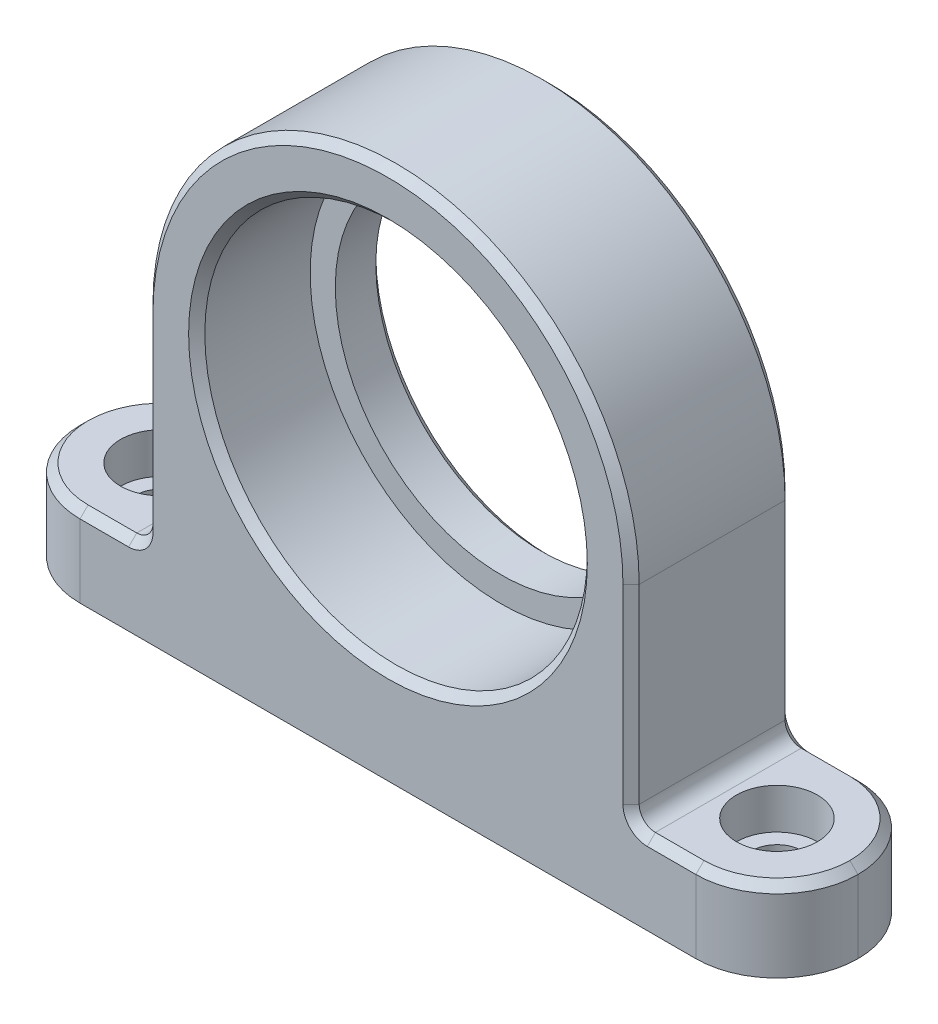
ISO-10303-21;
HEADER;
FILE_DESCRIPTION(('STEP AP214'),'2;1');
FILE_NAME('part.step','',(''),(''),'','','');
FILE_SCHEMA(('AUTOMOTIVE_DESIGN { 1 0 10303 214 1 1 1 1 }'));
ENDSEC;
DATA;
#1=APPLICATION_CONTEXT('core data for automotive mechanical design processes');
#2=APPLICATION_PROTOCOL_DEFINITION('international standard','automotive_design',2000,#1);
#3=PRODUCT_CONTEXT('',#1,'mechanical');
#4=PRODUCT('Part','Part','',(#3));
#5=PRODUCT_RELATED_PRODUCT_CATEGORY('part','',(#4));
#6=PRODUCT_DEFINITION_FORMATION('','',#4);
#7=PRODUCT_DEFINITION_CONTEXT('part definition',#1,'design');
#8=PRODUCT_DEFINITION('design','',#6,#7);
#9=PRODUCT_DEFINITION_SHAPE('','',#8);
#10=(LENGTH_UNIT() NAMED_UNIT(*) SI_UNIT(.MILLI.,.METRE.));
#11=(NAMED_UNIT(*) PLANE_ANGLE_UNIT() SI_UNIT($,.RADIAN.));
#12=(NAMED_UNIT(*) SI_UNIT($,.STERADIAN.) SOLID_ANGLE_UNIT());
#13=UNCERTAINTY_MEASURE_WITH_UNIT(LENGTH_MEASURE(1.E-05),#10,'distance_accuracy_value','');
#14=(GEOMETRIC_REPRESENTATION_CONTEXT(3) GLOBAL_UNCERTAINTY_ASSIGNED_CONTEXT((#13)) GLOBAL_UNIT_ASSIGNED_CONTEXT((#10,
#11,#12)) REPRESENTATION_CONTEXT('',''));
#15=CARTESIAN_POINT('',(0.,0.,0.));
#16=DIRECTION('',(0.,0.,1.));
#17=DIRECTION('',(1.,0.,0.));
#18=AXIS2_PLACEMENT_3D('',#15,#16,#17);
#19=CARTESIAN_POINT('',(-48.,10.,-10.));
#20=DIRECTION('',(0.,0.,-1.));
#21=DIRECTION('',(-1.,0.,0.));
#22=AXIS2_PLACEMENT_3D('',#19,#20,#21);
#23=PLANE('',#22);
#24=CARTESIAN_POINT('',(0.,35.5,-10.));
#25=DIRECTION('',(0.,0.,-1.));
#26=DIRECTION('',(-1.,0.,0.));
#27=AXIS2_PLACEMENT_3D('',#24,#25,#26);
#28=CIRCLE('',#27,21.5);
#29=CARTESIAN_POINT('',(-21.5,35.5,-10.));
#30=VERTEX_POINT('',#29);
#31=EDGE_CURVE('E385',#30,#30,#28,.F.);
#32=ORIENTED_EDGE('',*,*,#31,.T.);
#33=EDGE_LOOP('',(#32));
#34=FACE_BOUND('',#33,.T.);
#35=CARTESIAN_POINT('',(32.,12.,-10.));
#36=DIRECTION('',(0.,0.,-1.));
#37=DIRECTION('',(-1.,0.,0.));
#38=AXIS2_PLACEMENT_3D('',#35,#36,#37);
#39=CIRCLE('',#38,3.00000000000003);
#40=CARTESIAN_POINT('',(29.,12.,-10.));
#41=VERTEX_POINT('',#40);
#42=CARTESIAN_POINT('',(32.,8.99999999999997,-10.));
#43=VERTEX_POINT('',#42);
#44=EDGE_CURVE('E274',#41,#43,#39,.F.);
#45=ORIENTED_EDGE('',*,*,#44,.T.);
#46=DIRECTION('',(1.,0.,0.));
#47=VECTOR('',#46,1.);
#48=CARTESIAN_POINT('',(38.,8.99999999999997,-10.));
#49=LINE('',#48,#47);
#50=CARTESIAN_POINT('',(38.,8.99999999999997,-10.));
#51=VERTEX_POINT('',#50);
#52=EDGE_CURVE('E276',#43,#51,#49,.T.);
#53=ORIENTED_EDGE('',*,*,#52,.T.);
#54=DIRECTION('',(0.,-1.,0.));
#55=VECTOR('',#54,1.);
#56=CARTESIAN_POINT('',(38.,10.,-10.));
#57=LINE('',#56,#55);
#58=CARTESIAN_POINT('',(38.,0.,-10.));
#59=VERTEX_POINT('',#58);
#60=EDGE_CURVE('E200',#51,#59,#57,.T.);
#61=ORIENTED_EDGE('',*,*,#60,.T.);
#62=DIRECTION('',(1.,0.,0.));
#63=VECTOR('',#62,1.);
#64=CARTESIAN_POINT('',(-48.,0.,-10.));
#65=LINE('',#64,#63);
#66=CARTESIAN_POINT('',(-38.,0.,-10.));
#67=VERTEX_POINT('',#66);
#68=EDGE_CURVE('E193',#67,#59,#65,.T.);
#69=ORIENTED_EDGE('',*,*,#68,.F.);
#70=DIRECTION('',(0.,-1.,0.));
#71=VECTOR('',#70,1.);
#72=CARTESIAN_POINT('',(-38.,10.,-10.));
#73=LINE('',#72,#71);
#74=CARTESIAN_POINT('',(-38.,8.99999999999997,-10.));
#75=VERTEX_POINT('',#74);
#76=EDGE_CURVE('E204',#67,#75,#73,.F.);
#77=ORIENTED_EDGE('',*,*,#76,.T.);
#78=DIRECTION('',(1.,0.,0.));
#79=VECTOR('',#78,1.);
#80=CARTESIAN_POINT('',(-32.,8.99999999999997,-10.));
#81=LINE('',#80,#79);
#82=CARTESIAN_POINT('',(-32.,8.99999999999997,-10.));
#83=VERTEX_POINT('',#82);
#84=EDGE_CURVE('E263',#75,#83,#81,.T.);
#85=ORIENTED_EDGE('',*,*,#84,.T.);
#86=CARTESIAN_POINT('',(-32.,12.,-10.));
#87=DIRECTION('',(0.,0.,-1.));
#88=DIRECTION('',(-1.,0.,0.));
#89=AXIS2_PLACEMENT_3D('',#86,#87,#88);
#90=CIRCLE('',#89,3.00000000000003);
#91=CARTESIAN_POINT('',(-29.,12.,-10.));
#92=VERTEX_POINT('',#91);
#93=EDGE_CURVE('E265',#83,#92,#90,.F.);
#94=ORIENTED_EDGE('',*,*,#93,.T.);
#95=DIRECTION('',(0.,1.,0.));
#96=VECTOR('',#95,1.);
#97=CARTESIAN_POINT('',(-29.,35.5,-10.));
#98=LINE('',#97,#96);
#99=CARTESIAN_POINT('',(-29.,35.5,-10.));
#100=VERTEX_POINT('',#99);
#101=EDGE_CURVE('E267',#92,#100,#98,.T.);
#102=ORIENTED_EDGE('',*,*,#101,.T.);
#103=CARTESIAN_POINT('',(0.,35.5,-10.));
#104=DIRECTION('',(0.,0.,-1.));
#105=DIRECTION('',(-1.,0.,0.));
#106=AXIS2_PLACEMENT_3D('',#103,#104,#105);
#107=CIRCLE('',#106,29.);
#108=CARTESIAN_POINT('',(29.,35.5,-10.));
#109=VERTEX_POINT('',#108);
#110=EDGE_CURVE('E269',#100,#109,#107,.T.);
#111=ORIENTED_EDGE('',*,*,#110,.T.);
#112=DIRECTION('',(0.,-1.,0.));
#113=VECTOR('',#112,1.);
#114=CARTESIAN_POINT('',(29.,12.,-10.));
#115=LINE('',#114,#113);
#116=EDGE_CURVE('E272',#109,#41,#115,.T.);
#117=ORIENTED_EDGE('',*,*,#116,.T.);
#118=EDGE_LOOP('',(#45,#53,#61,#69,#77,#85,#94,#102,#111,#117));
#119=FACE_BOUND('',#118,.T.);
#120=ADVANCED_FACE('F44',(#34,#119),#23,.T.);
#121=CARTESIAN_POINT('',(-48.,10.,10.));
#122=DIRECTION('',(0.,0.,-1.));
#123=DIRECTION('',(-1.,0.,0.));
#124=AXIS2_PLACEMENT_3D('',#121,#122,#123);
#125=PLANE('',#124);
#126=CARTESIAN_POINT('',(0.,35.5,10.));
#127=DIRECTION('',(0.,0.,-1.));
#128=DIRECTION('',(-1.,0.,0.));
#129=AXIS2_PLACEMENT_3D('',#126,#127,#128);
#130=CIRCLE('',#129,24.6);
#131=CARTESIAN_POINT('',(-24.6,35.5,10.));
#132=VERTEX_POINT('',#131);
#133=EDGE_CURVE('E11',#132,#132,#130,.T.);
#134=ORIENTED_EDGE('',*,*,#133,.T.);
#135=EDGE_LOOP('',(#134));
#136=FACE_BOUND('',#135,.T.);
#137=DIRECTION('',(0.,-1.,0.));
#138=VECTOR('',#137,1.);
#139=CARTESIAN_POINT('',(38.,10.,10.));
#140=LINE('',#139,#138);
#141=CARTESIAN_POINT('',(38.,0.,10.));
#142=VERTEX_POINT('',#141);
#143=CARTESIAN_POINT('',(38.,8.99999999999997,10.));
#144=VERTEX_POINT('',#143);
#145=EDGE_CURVE('E226',#142,#144,#140,.F.);
#146=ORIENTED_EDGE('',*,*,#145,.T.);
#147=DIRECTION('',(-1.,0.,0.));
#148=VECTOR('',#147,1.);
#149=CARTESIAN_POINT('',(-48.,8.99999999999997,10.));
#150=LINE('',#149,#148);
#151=CARTESIAN_POINT('',(32.,8.99999999999997,10.));
#152=VERTEX_POINT('',#151);
#153=EDGE_CURVE('E60',#144,#152,#150,.T.);
#154=ORIENTED_EDGE('',*,*,#153,.T.);
#155=CARTESIAN_POINT('',(32.,12.,10.));
#156=DIRECTION('',(0.,0.,-1.));
#157=DIRECTION('',(-1.,0.,0.));
#158=AXIS2_PLACEMENT_3D('',#155,#156,#157);
#159=CIRCLE('',#158,3.00000000000003);
#160=CARTESIAN_POINT('',(29.,12.,10.));
#161=VERTEX_POINT('',#160);
#162=EDGE_CURVE('E324',#152,#161,#159,.T.);
#163=ORIENTED_EDGE('',*,*,#162,.T.);
#164=DIRECTION('',(0.,1.,0.));
#165=VECTOR('',#164,1.);
#166=CARTESIAN_POINT('',(29.,10.,10.));
#167=LINE('',#166,#165);
#168=CARTESIAN_POINT('',(29.,35.5,10.));
#169=VERTEX_POINT('',#168);
#170=EDGE_CURVE('E321',#161,#169,#167,.T.);
#171=ORIENTED_EDGE('',*,*,#170,.T.);
#172=CARTESIAN_POINT('',(0.,35.5,10.));
#173=DIRECTION('',(0.,0.,-1.));
#174=DIRECTION('',(-1.,0.,0.));
#175=AXIS2_PLACEMENT_3D('',#172,#173,#174);
#176=CIRCLE('',#175,29.);
#177=CARTESIAN_POINT('',(-29.,35.5,10.));
#178=VERTEX_POINT('',#177);
#179=EDGE_CURVE('E317',#169,#178,#176,.F.);
#180=ORIENTED_EDGE('',*,*,#179,.T.);
#181=DIRECTION('',(0.,-1.,0.));
#182=VECTOR('',#181,1.);
#183=CARTESIAN_POINT('',(-29.,10.,10.));
#184=LINE('',#183,#182);
#185=CARTESIAN_POINT('',(-29.,12.,10.));
#186=VERTEX_POINT('',#185);
#187=EDGE_CURVE('E319',#178,#186,#184,.T.);
#188=ORIENTED_EDGE('',*,*,#187,.T.);
#189=CARTESIAN_POINT('',(-32.,12.,10.));
#190=DIRECTION('',(0.,0.,-1.));
#191=DIRECTION('',(-1.,0.,0.));
#192=AXIS2_PLACEMENT_3D('',#189,#190,#191);
#193=CIRCLE('',#192,3.00000000000003);
#194=CARTESIAN_POINT('',(-32.,8.99999999999997,10.));
#195=VERTEX_POINT('',#194);
#196=EDGE_CURVE('E67',#186,#195,#193,.T.);
#197=ORIENTED_EDGE('',*,*,#196,.T.);
#198=DIRECTION('',(-1.,0.,0.));
#199=VECTOR('',#198,1.);
#200=CARTESIAN_POINT('',(-48.,8.99999999999997,10.));
#201=LINE('',#200,#199);
#202=CARTESIAN_POINT('',(-38.,8.99999999999997,10.));
#203=VERTEX_POINT('',#202);
#204=EDGE_CURVE('E326',#195,#203,#201,.T.);
#205=ORIENTED_EDGE('',*,*,#204,.T.);
#206=DIRECTION('',(0.,-1.,0.));
#207=VECTOR('',#206,1.);
#208=CARTESIAN_POINT('',(-38.,10.,10.));
#209=LINE('',#208,#207);
#210=CARTESIAN_POINT('',(-38.,0.,10.));
#211=VERTEX_POINT('',#210);
#212=EDGE_CURVE('E224',#203,#211,#209,.T.);
#213=ORIENTED_EDGE('',*,*,#212,.T.);
#214=DIRECTION('',(1.,0.,0.));
#215=VECTOR('',#214,1.);
#216=CARTESIAN_POINT('',(-48.,0.,10.));
#217=LINE('',#216,#215);
#218=EDGE_CURVE('E208',#211,#142,#217,.T.);
#219=ORIENTED_EDGE('',*,*,#218,.T.);
#220=EDGE_LOOP('',(#146,#154,#163,#171,#180,#188,#197,#205,#213,#219));
#221=FACE_BOUND('',#220,.T.);
#222=ADVANCED_FACE('F403',(#136,#221),#125,.F.);
#223=CARTESIAN_POINT('',(30.,65.5,10.));
#224=DIRECTION('',(-1.,0.,0.));
#225=DIRECTION('',(0.,0.,1.));
#226=AXIS2_PLACEMENT_3D('',#223,#224,#225);
#227=PLANE('',#226);
#228=DIRECTION('',(0.,0.,-1.));
#229=VECTOR('',#228,1.);
#230=CARTESIAN_POINT('',(30.,12.,-10.));
#231=LINE('',#230,#229);
#232=CARTESIAN_POINT('',(30.,12.,8.99999999999999));
#233=VERTEX_POINT('',#232);
#234=CARTESIAN_POINT('',(30.,12.,-8.99999999999998));
#235=VERTEX_POINT('',#234);
#236=EDGE_CURVE('E246',#233,#235,#231,.T.);
#237=ORIENTED_EDGE('',*,*,#236,.T.);
#238=DIRECTION('',(0.,1.,0.));
#239=VECTOR('',#238,1.);
#240=CARTESIAN_POINT('',(30.,35.5,-8.99999999999998));
#241=LINE('',#240,#239);
#242=CARTESIAN_POINT('',(30.,35.5,-8.99999999999998));
#243=VERTEX_POINT('',#242);
#244=EDGE_CURVE('E280',#235,#243,#241,.T.);
#245=ORIENTED_EDGE('',*,*,#244,.T.);
#246=DIRECTION('',(0.,0.,-1.));
#247=VECTOR('',#246,1.);
#248=CARTESIAN_POINT('',(30.,35.5,157.405955188384));
#249=LINE('',#248,#247);
#250=CARTESIAN_POINT('',(30.,35.5,8.99999999999998));
#251=VERTEX_POINT('',#250);
#252=EDGE_CURVE('E616',#251,#243,#249,.T.);
#253=ORIENTED_EDGE('',*,*,#252,.F.);
#254=DIRECTION('',(0.,-1.,0.));
#255=VECTOR('',#254,1.);
#256=CARTESIAN_POINT('',(30.,65.5,8.99999999999999));
#257=LINE('',#256,#255);
#258=EDGE_CURVE('E278',#251,#233,#257,.T.);
#259=ORIENTED_EDGE('',*,*,#258,.T.);
#260=EDGE_LOOP('',(#237,#245,#253,#259));
#261=FACE_BOUND('',#260,.T.);
#262=ADVANCED_FACE('F409',(#261),#227,.F.);
#263=CARTESIAN_POINT('',(0.,10.,0.));
#264=DIRECTION('',(0.,-1.,0.));
#265=DIRECTION('',(0.,0.,-1.));
#266=AXIS2_PLACEMENT_3D('',#263,#264,#265);
#267=PLANE('',#266);
#268=CARTESIAN_POINT('',(38.,10.,1.58206781009085E-13));
#269=DIRECTION('',(0.,1.,0.));
#270=DIRECTION('',(0.,0.,-1.));
#271=AXIS2_PLACEMENT_3D('',#268,#269,#270);
#272=CIRCLE('',#271,5.);
#273=CARTESIAN_POINT('',(38.,10.,-4.99999999999984));
#274=VERTEX_POINT('',#273);
#275=EDGE_CURVE('E231',#274,#274,#272,.T.);
#276=ORIENTED_EDGE('',*,*,#275,.F.);
#277=EDGE_LOOP('',(#276));
#278=FACE_BOUND('',#277,.T.);
#279=CARTESIAN_POINT('',(38.,10.,0.));
#280=DIRECTION('',(0.,-1.,0.));
#281=DIRECTION('',(0.,0.,-1.));
#282=AXIS2_PLACEMENT_3D('',#279,#280,#281);
#283=CIRCLE('',#282,8.99999999999998);
#284=CARTESIAN_POINT('',(47.,10.,0.));
#285=VERTEX_POINT('',#284);
#286=CARTESIAN_POINT('',(38.,10.,-8.99999999999998));
#287=VERTEX_POINT('',#286);
#288=EDGE_CURVE('E298',#285,#287,#283,.F.);
#289=ORIENTED_EDGE('',*,*,#288,.T.);
#290=DIRECTION('',(-1.,0.,0.));
#291=VECTOR('',#290,1.);
#292=CARTESIAN_POINT('',(32.,10.,-8.99999999999998));
#293=LINE('',#292,#291);
#294=CARTESIAN_POINT('',(32.,10.,-8.99999999999998));
#295=VERTEX_POINT('',#294);
#296=EDGE_CURVE('E300',#287,#295,#293,.T.);
#297=ORIENTED_EDGE('',*,*,#296,.T.);
#298=DIRECTION('',(0.,0.,-1.));
#299=VECTOR('',#298,1.);
#300=CARTESIAN_POINT('',(32.,10.,10.));
#301=LINE('',#300,#299);
#302=CARTESIAN_POINT('',(32.,10.,8.99999999999999));
#303=VERTEX_POINT('',#302);
#304=EDGE_CURVE('E249',#295,#303,#301,.F.);
#305=ORIENTED_EDGE('',*,*,#304,.T.);
#306=DIRECTION('',(1.,0.,0.));
#307=VECTOR('',#306,1.);
#308=CARTESIAN_POINT('',(0.,10.,8.99999999999999));
#309=LINE('',#308,#307);
#310=CARTESIAN_POINT('',(38.,10.,8.99999999999999));
#311=VERTEX_POINT('',#310);
#312=EDGE_CURVE('E294',#303,#311,#309,.T.);
#313=ORIENTED_EDGE('',*,*,#312,.T.);
#314=CARTESIAN_POINT('',(38.,10.,0.));
#315=DIRECTION('',(0.,-1.,0.));
#316=DIRECTION('',(0.,0.,-1.));
#317=AXIS2_PLACEMENT_3D('',#314,#315,#316);
#318=CIRCLE('',#317,8.99999999999998);
#319=EDGE_CURVE('E296',#311,#285,#318,.F.);
#320=ORIENTED_EDGE('',*,*,#319,.T.);
#321=EDGE_LOOP('',(#289,#297,#305,#313,#320));
#322=FACE_BOUND('',#321,.T.);
#323=ADVANCED_FACE('F603',(#278,#322),#267,.F.);
#324=CARTESIAN_POINT('',(-38.,10.,0.));
#325=DIRECTION('',(0.,1.,0.));
#326=DIRECTION('',(0.,0.,1.));
#327=AXIS2_PLACEMENT_3D('',#324,#325,#326);
#328=CIRCLE('',#327,5.);
#329=CARTESIAN_POINT('',(-38.,10.,5.));
#330=VERTEX_POINT('',#329);
#331=EDGE_CURVE('E634',#330,#330,#328,.T.);
#332=ORIENTED_EDGE('',*,*,#331,.F.);
#333=EDGE_LOOP('',(#332));
#334=FACE_BOUND('',#333,.T.);
#335=DIRECTION('',(0.,0.,1.));
#336=VECTOR('',#335,1.);
#337=CARTESIAN_POINT('',(-32.,10.,-10.));
#338=LINE('',#337,#336);
#339=CARTESIAN_POINT('',(-32.,10.,8.99999999999999));
#340=VERTEX_POINT('',#339);
#341=CARTESIAN_POINT('',(-32.,10.,-8.99999999999998));
#342=VERTEX_POINT('',#341);
#343=EDGE_CURVE('E255',#340,#342,#338,.F.);
#344=ORIENTED_EDGE('',*,*,#343,.T.);
#345=DIRECTION('',(-1.,0.,0.));
#346=VECTOR('',#345,1.);
#347=CARTESIAN_POINT('',(-38.,10.,-8.99999999999998));
#348=LINE('',#347,#346);
#349=CARTESIAN_POINT('',(-38.,10.,-8.99999999999998));
#350=VERTEX_POINT('',#349);
#351=EDGE_CURVE('E308',#342,#350,#348,.T.);
#352=ORIENTED_EDGE('',*,*,#351,.T.);
#353=CARTESIAN_POINT('',(-38.,10.,0.));
#354=DIRECTION('',(0.,-1.,0.));
#355=DIRECTION('',(0.,0.,-1.));
#356=AXIS2_PLACEMENT_3D('',#353,#354,#355);
#357=CIRCLE('',#356,8.99999999999998);
#358=CARTESIAN_POINT('',(-47.,10.,0.));
#359=VERTEX_POINT('',#358);
#360=EDGE_CURVE('E306',#350,#359,#357,.F.);
#361=ORIENTED_EDGE('',*,*,#360,.T.);
#362=CARTESIAN_POINT('',(-38.,10.,0.));
#363=DIRECTION('',(0.,-1.,0.));
#364=DIRECTION('',(0.,0.,-1.));
#365=AXIS2_PLACEMENT_3D('',#362,#363,#364);
#366=CIRCLE('',#365,8.99999999999998);
#367=CARTESIAN_POINT('',(-38.,10.,8.99999999999999));
#368=VERTEX_POINT('',#367);
#369=EDGE_CURVE('E304',#359,#368,#366,.F.);
#370=ORIENTED_EDGE('',*,*,#369,.T.);
#371=DIRECTION('',(1.,0.,0.));
#372=VECTOR('',#371,1.);
#373=CARTESIAN_POINT('',(0.,10.,8.99999999999999));
#374=LINE('',#373,#372);
#375=EDGE_CURVE('E302',#368,#340,#374,.T.);
#376=ORIENTED_EDGE('',*,*,#375,.T.);
#377=EDGE_LOOP('',(#344,#352,#361,#370,#376));
#378=FACE_BOUND('',#377,.T.);
#379=ADVANCED_FACE('F646',(#334,#378),#267,.F.);
#380=CARTESIAN_POINT('',(0.,0.,0.));
#381=DIRECTION('',(0.,-1.,0.));
#382=DIRECTION('',(0.,0.,-1.));
#383=AXIS2_PLACEMENT_3D('',#380,#381,#382);
#384=PLANE('',#383);
#385=CARTESIAN_POINT('',(38.,0.,1.58206781009085E-13));
#386=DIRECTION('',(0.,-1.,0.));
#387=DIRECTION('',(0.,0.,-1.));
#388=AXIS2_PLACEMENT_3D('',#385,#386,#387);
#389=CIRCLE('',#388,4.10000000000001);
#390=CARTESIAN_POINT('',(38.,0.,-4.09999999999985));
#391=VERTEX_POINT('',#390);
#392=EDGE_CURVE('E237',#391,#391,#389,.F.);
#393=ORIENTED_EDGE('',*,*,#392,.T.);
#394=EDGE_LOOP('',(#393));
#395=FACE_BOUND('',#394,.T.);
#396=CARTESIAN_POINT('',(-38.,0.,0.));
#397=DIRECTION('',(0.,-1.,0.));
#398=DIRECTION('',(0.,0.,-1.));
#399=AXIS2_PLACEMENT_3D('',#396,#397,#398);
#400=CIRCLE('',#399,4.10000000000001);
#401=CARTESIAN_POINT('',(-38.,0.,-4.10000000000001));
#402=VERTEX_POINT('',#401);
#403=EDGE_CURVE('E228',#402,#402,#400,.F.);
#404=ORIENTED_EDGE('',*,*,#403,.T.);
#405=EDGE_LOOP('',(#404));
#406=FACE_BOUND('',#405,.T.);
#407=ORIENTED_EDGE('',*,*,#68,.T.);
#408=CARTESIAN_POINT('',(38.,0.,0.));
#409=DIRECTION('',(0.,-1.,0.));
#410=DIRECTION('',(0.,0.,-1.));
#411=AXIS2_PLACEMENT_3D('',#408,#409,#410);
#412=CIRCLE('',#411,10.);
#413=CARTESIAN_POINT('',(48.,0.,0.));
#414=VERTEX_POINT('',#413);
#415=EDGE_CURVE('E222',#59,#414,#412,.T.);
#416=ORIENTED_EDGE('',*,*,#415,.T.);
#417=CARTESIAN_POINT('',(38.,0.,0.));
#418=DIRECTION('',(0.,-1.,0.));
#419=DIRECTION('',(0.,0.,-1.));
#420=AXIS2_PLACEMENT_3D('',#417,#418,#419);
#421=CIRCLE('',#420,10.);
#422=EDGE_CURVE('E220',#414,#142,#421,.T.);
#423=ORIENTED_EDGE('',*,*,#422,.T.);
#424=ORIENTED_EDGE('',*,*,#218,.F.);
#425=CARTESIAN_POINT('',(-38.,0.,0.));
#426=DIRECTION('',(0.,-1.,0.));
#427=DIRECTION('',(0.,0.,-1.));
#428=AXIS2_PLACEMENT_3D('',#425,#426,#427);
#429=CIRCLE('',#428,10.);
#430=CARTESIAN_POINT('',(-48.,0.,0.));
#431=VERTEX_POINT('',#430);
#432=EDGE_CURVE('E196',#211,#431,#429,.T.);
#433=ORIENTED_EDGE('',*,*,#432,.T.);
#434=CARTESIAN_POINT('',(-38.,0.,0.));
#435=DIRECTION('',(0.,-1.,0.));
#436=DIRECTION('',(0.,0.,-1.));
#437=AXIS2_PLACEMENT_3D('',#434,#435,#436);
#438=CIRCLE('',#437,10.);
#439=EDGE_CURVE('E189',#431,#67,#438,.T.);
#440=ORIENTED_EDGE('',*,*,#439,.T.);
#441=EDGE_LOOP('',(#407,#416,#423,#424,#433,#440));
#442=FACE_BOUND('',#441,.T.);
#443=ADVANCED_FACE('F191',(#395,#406,#442),#384,.T.);
#444=CARTESIAN_POINT('',(38.,5.,1.58206781009085E-13));
#445=DIRECTION('',(0.,1.,0.));
#446=DIRECTION('',(0.,0.,1.));
#447=AXIS2_PLACEMENT_3D('',#444,#445,#446);
#448=CYLINDRICAL_SURFACE('',#447,5.);
#449=CARTESIAN_POINT('',(38.,5.,1.58206781009085E-13));
#450=DIRECTION('',(0.,1.,0.));
#451=DIRECTION('',(0.,0.,-1.));
#452=AXIS2_PLACEMENT_3D('',#449,#450,#451);
#453=CIRCLE('',#452,5.);
#454=CARTESIAN_POINT('',(38.,5.,-4.99999999999984));
#455=VERTEX_POINT('',#454);
#456=EDGE_CURVE('E637',#455,#455,#453,.T.);
#457=ORIENTED_EDGE('',*,*,#456,.F.);
#458=EDGE_LOOP('',(#457));
#459=FACE_BOUND('',#458,.T.);
#460=ORIENTED_EDGE('',*,*,#275,.T.);
#461=EDGE_LOOP('',(#460));
#462=FACE_BOUND('',#461,.T.);
#463=ADVANCED_FACE('F643',(#459,#462),#448,.F.);
#464=CARTESIAN_POINT('',(38.,5.,1.58206781009085E-13));
#465=DIRECTION('',(0.,-1.,0.));
#466=DIRECTION('',(0.,0.,-1.));
#467=AXIS2_PLACEMENT_3D('',#464,#465,#466);
#468=PLANE('',#467);
#469=CARTESIAN_POINT('',(38.,5.,1.58206781009085E-13));
#470=DIRECTION('',(0.,1.,0.));
#471=DIRECTION('',(0.,0.,1.));
#472=AXIS2_PLACEMENT_3D('',#469,#470,#471);
#473=CIRCLE('',#472,3.1);
#474=CARTESIAN_POINT('',(38.,5.,3.10000000000016));
#475=VERTEX_POINT('',#474);
#476=EDGE_CURVE('E623',#475,#475,#473,.T.);
#477=ORIENTED_EDGE('',*,*,#476,.F.);
#478=EDGE_LOOP('',(#477));
#479=FACE_BOUND('',#478,.T.);
#480=ORIENTED_EDGE('',*,*,#456,.T.);
#481=EDGE_LOOP('',(#480));
#482=FACE_BOUND('',#481,.T.);
#483=ADVANCED_FACE('F661',(#479,#482),#468,.F.);
#484=CARTESIAN_POINT('',(-38.,5.,0.));
#485=DIRECTION('',(0.,1.,0.));
#486=DIRECTION('',(0.,0.,1.));
#487=AXIS2_PLACEMENT_3D('',#484,#485,#486);
#488=CYLINDRICAL_SURFACE('',#487,5.);
#489=CARTESIAN_POINT('',(-38.,5.,0.));
#490=DIRECTION('',(0.,1.,0.));
#491=DIRECTION('',(0.,0.,1.));
#492=AXIS2_PLACEMENT_3D('',#489,#490,#491);
#493=CIRCLE('',#492,5.);
#494=CARTESIAN_POINT('',(-38.,5.,5.));
#495=VERTEX_POINT('',#494);
#496=EDGE_CURVE('E209',#495,#495,#493,.T.);
#497=ORIENTED_EDGE('',*,*,#496,.F.);
#498=EDGE_LOOP('',(#497));
#499=FACE_BOUND('',#498,.T.);
#500=ORIENTED_EDGE('',*,*,#331,.T.);
#501=EDGE_LOOP('',(#500));
#502=FACE_BOUND('',#501,.T.);
#503=ADVANCED_FACE('F671',(#499,#502),#488,.F.);
#504=CARTESIAN_POINT('',(-38.,5.,0.));
#505=DIRECTION('',(0.,1.,0.));
#506=DIRECTION('',(0.,0.,1.));
#507=AXIS2_PLACEMENT_3D('',#504,#505,#506);
#508=PLANE('',#507);
#509=CARTESIAN_POINT('',(-38.,5.,0.));
#510=DIRECTION('',(0.,1.,0.));
#511=DIRECTION('',(0.,0.,1.));
#512=AXIS2_PLACEMENT_3D('',#509,#510,#511);
#513=CIRCLE('',#512,3.1);
#514=CARTESIAN_POINT('',(-38.,5.,3.1));
#515=VERTEX_POINT('',#514);
#516=EDGE_CURVE('E234',#515,#515,#513,.T.);
#517=ORIENTED_EDGE('',*,*,#516,.F.);
#518=EDGE_LOOP('',(#517));
#519=FACE_BOUND('',#518,.T.);
#520=ORIENTED_EDGE('',*,*,#496,.T.);
#521=EDGE_LOOP('',(#520));
#522=FACE_BOUND('',#521,.T.);
#523=ADVANCED_FACE('F421',(#519,#522),#508,.T.);
#524=CARTESIAN_POINT('',(38.,10.,0.));
#525=DIRECTION('',(0.,1.,0.));
#526=DIRECTION('',(0.,0.,1.));
#527=AXIS2_PLACEMENT_3D('',#524,#525,#526);
#528=CYLINDRICAL_SURFACE('',#527,10.);
#529=DIRECTION('',(0.,-1.,0.));
#530=VECTOR('',#529,1.);
#531=CARTESIAN_POINT('',(48.,0.,0.));
#532=LINE('',#531,#530);
#533=CARTESIAN_POINT('',(48.,8.99999999999997,0.));
#534=VERTEX_POINT('',#533);
#535=EDGE_CURVE('E229',#534,#414,#532,.T.);
#536=ORIENTED_EDGE('',*,*,#535,.F.);
#537=CARTESIAN_POINT('',(38.,8.99999999999997,0.));
#538=DIRECTION('',(0.,-1.,0.));
#539=DIRECTION('',(0.,0.,-1.));
#540=AXIS2_PLACEMENT_3D('',#537,#538,#539);
#541=CIRCLE('',#540,10.);
#542=EDGE_CURVE('E313',#534,#144,#541,.T.);
#543=ORIENTED_EDGE('',*,*,#542,.T.);
#544=ORIENTED_EDGE('',*,*,#145,.F.);
#545=ORIENTED_EDGE('',*,*,#422,.F.);
#546=EDGE_LOOP('',(#536,#543,#544,#545));
#547=FACE_BOUND('',#546,.T.);
#548=ADVANCED_FACE('F417',(#547),#528,.T.);
#549=CARTESIAN_POINT('',(38.,10.,0.));
#550=DIRECTION('',(0.,-1.,0.));
#551=DIRECTION('',(0.,0.,-1.));
#552=AXIS2_PLACEMENT_3D('',#549,#550,#551);
#553=CYLINDRICAL_SURFACE('',#552,10.);
#554=ORIENTED_EDGE('',*,*,#60,.F.);
#555=CARTESIAN_POINT('',(38.,8.99999999999997,0.));
#556=DIRECTION('',(0.,-1.,0.));
#557=DIRECTION('',(0.,0.,-1.));
#558=AXIS2_PLACEMENT_3D('',#555,#556,#557);
#559=CIRCLE('',#558,10.);
#560=EDGE_CURVE('E310',#51,#534,#559,.T.);
#561=ORIENTED_EDGE('',*,*,#560,.T.);
#562=ORIENTED_EDGE('',*,*,#535,.T.);
#563=ORIENTED_EDGE('',*,*,#415,.F.);
#564=EDGE_LOOP('',(#554,#561,#562,#563));
#565=FACE_BOUND('',#564,.T.);
#566=ADVANCED_FACE('F414',(#565),#553,.T.);
#567=CARTESIAN_POINT('',(-38.,10.,0.));
#568=DIRECTION('',(0.,1.,0.));
#569=DIRECTION('',(0.,0.,1.));
#570=AXIS2_PLACEMENT_3D('',#567,#568,#569);
#571=CYLINDRICAL_SURFACE('',#570,10.);
#572=DIRECTION('',(0.,-1.,0.));
#573=VECTOR('',#572,1.);
#574=CARTESIAN_POINT('',(-48.,0.,0.));
#575=LINE('',#574,#573);
#576=CARTESIAN_POINT('',(-48.,8.99999999999997,0.));
#577=VERTEX_POINT('',#576);
#578=EDGE_CURVE('E232',#577,#431,#575,.T.);
#579=ORIENTED_EDGE('',*,*,#578,.F.);
#580=CARTESIAN_POINT('',(-38.,8.99999999999997,0.));
#581=DIRECTION('',(0.,-1.,0.));
#582=DIRECTION('',(0.,0.,-1.));
#583=AXIS2_PLACEMENT_3D('',#580,#581,#582);
#584=CIRCLE('',#583,10.);
#585=EDGE_CURVE('E213',#577,#75,#584,.T.);
#586=ORIENTED_EDGE('',*,*,#585,.T.);
#587=ORIENTED_EDGE('',*,*,#76,.F.);
#588=ORIENTED_EDGE('',*,*,#439,.F.);
#589=EDGE_LOOP('',(#579,#586,#587,#588));
#590=FACE_BOUND('',#589,.T.);
#591=ADVANCED_FACE('F211',(#590),#571,.T.);
#592=CARTESIAN_POINT('',(-38.,10.,0.));
#593=DIRECTION('',(0.,-1.,0.));
#594=DIRECTION('',(0.,0.,-1.));
#595=AXIS2_PLACEMENT_3D('',#592,#593,#594);
#596=CYLINDRICAL_SURFACE('',#595,10.);
#597=ORIENTED_EDGE('',*,*,#212,.F.);
#598=CARTESIAN_POINT('',(-38.,8.99999999999997,0.));
#599=DIRECTION('',(0.,-1.,0.));
#600=DIRECTION('',(0.,0.,-1.));
#601=AXIS2_PLACEMENT_3D('',#598,#599,#600);
#602=CIRCLE('',#601,10.);
#603=EDGE_CURVE('E315',#203,#577,#602,.T.);
#604=ORIENTED_EDGE('',*,*,#603,.T.);
#605=ORIENTED_EDGE('',*,*,#578,.T.);
#606=ORIENTED_EDGE('',*,*,#432,.F.);
#607=EDGE_LOOP('',(#597,#604,#605,#606));
#608=FACE_BOUND('',#607,.T.);
#609=ADVANCED_FACE('F423',(#608),#596,.T.);
#610=CARTESIAN_POINT('',(38.,0.,1.58206781009085E-13));
#611=DIRECTION('',(0.,1.,0.));
#612=DIRECTION('',(0.,0.,1.));
#613=AXIS2_PLACEMENT_3D('',#610,#611,#612);
#614=CYLINDRICAL_SURFACE('',#613,3.1);
#615=CARTESIAN_POINT('',(38.,0.999999999999994,1.58206781009085E-13));
#616=DIRECTION('',(0.,-1.,0.));
#617=DIRECTION('',(0.,0.,-1.));
#618=AXIS2_PLACEMENT_3D('',#615,#616,#617);
#619=CIRCLE('',#618,3.1);
#620=CARTESIAN_POINT('',(38.,0.999999999999994,-3.09999999999984));
#621=VERTEX_POINT('',#620);
#622=EDGE_CURVE('E240',#621,#621,#619,.T.);
#623=ORIENTED_EDGE('',*,*,#622,.T.);
#624=EDGE_LOOP('',(#623));
#625=FACE_BOUND('',#624,.T.);
#626=ORIENTED_EDGE('',*,*,#476,.T.);
#627=EDGE_LOOP('',(#626));
#628=FACE_BOUND('',#627,.T.);
#629=ADVANCED_FACE('F426',(#625,#628),#614,.F.);
#630=CARTESIAN_POINT('',(-38.,0.,0.));
#631=DIRECTION('',(0.,1.,0.));
#632=DIRECTION('',(0.,0.,1.));
#633=AXIS2_PLACEMENT_3D('',#630,#631,#632);
#634=CYLINDRICAL_SURFACE('',#633,3.1);
#635=CARTESIAN_POINT('',(-38.,0.999999999999994,0.));
#636=DIRECTION('',(0.,-1.,0.));
#637=DIRECTION('',(0.,0.,-1.));
#638=AXIS2_PLACEMENT_3D('',#635,#636,#637);
#639=CIRCLE('',#638,3.1);
#640=CARTESIAN_POINT('',(-38.,0.999999999999994,-3.1));
#641=VERTEX_POINT('',#640);
#642=EDGE_CURVE('E243',#641,#641,#639,.T.);
#643=ORIENTED_EDGE('',*,*,#642,.T.);
#644=EDGE_LOOP('',(#643));
#645=FACE_BOUND('',#644,.T.);
#646=ORIENTED_EDGE('',*,*,#516,.T.);
#647=EDGE_LOOP('',(#646));
#648=FACE_BOUND('',#647,.T.);
#649=ADVANCED_FACE('F438',(#645,#648),#634,.F.);
#650=CARTESIAN_POINT('',(38.,0.,1.58206781009085E-13));
#651=DIRECTION('',(0.,-1.,0.));
#652=DIRECTION('',(0.,0.,-1.));
#653=AXIS2_PLACEMENT_3D('',#650,#651,#652);
#654=CONICAL_SURFACE('',#653,4.10000000000001,0.785398163397454);
#655=ORIENTED_EDGE('',*,*,#622,.F.);
#656=EDGE_LOOP('',(#655));
#657=FACE_BOUND('',#656,.T.);
#658=ORIENTED_EDGE('',*,*,#392,.F.);
#659=EDGE_LOOP('',(#658));
#660=FACE_BOUND('',#659,.T.);
#661=ADVANCED_FACE('F431',(#657,#660),#654,.F.);
#662=CARTESIAN_POINT('',(-38.,0.,0.));
#663=DIRECTION('',(0.,-1.,0.));
#664=DIRECTION('',(0.,0.,-1.));
#665=AXIS2_PLACEMENT_3D('',#662,#663,#664);
#666=CONICAL_SURFACE('',#665,4.10000000000001,0.785398163397454);
#667=ORIENTED_EDGE('',*,*,#642,.F.);
#668=EDGE_LOOP('',(#667));
#669=FACE_BOUND('',#668,.T.);
#670=ORIENTED_EDGE('',*,*,#403,.F.);
#671=EDGE_LOOP('',(#670));
#672=FACE_BOUND('',#671,.T.);
#673=ADVANCED_FACE('F437',(#669,#672),#666,.F.);
#674=CARTESIAN_POINT('',(-30.,65.5,10.));
#675=DIRECTION('',(1.,0.,0.));
#676=DIRECTION('',(0.,0.,-1.));
#677=AXIS2_PLACEMENT_3D('',#674,#675,#676);
#678=PLANE('',#677);
#679=DIRECTION('',(0.,0.,-1.));
#680=VECTOR('',#679,1.);
#681=CARTESIAN_POINT('',(-30.,35.5,157.405955188384));
#682=LINE('',#681,#680);
#683=CARTESIAN_POINT('',(-30.,35.5,8.99999999999998));
#684=VERTEX_POINT('',#683);
#685=CARTESIAN_POINT('',(-30.,35.5,-8.99999999999998));
#686=VERTEX_POINT('',#685);
#687=EDGE_CURVE('E619',#684,#686,#682,.T.);
#688=ORIENTED_EDGE('',*,*,#687,.T.);
#689=DIRECTION('',(0.,-1.,0.));
#690=VECTOR('',#689,1.);
#691=CARTESIAN_POINT('',(-30.,12.,-8.99999999999998));
#692=LINE('',#691,#690);
#693=CARTESIAN_POINT('',(-30.,12.,-8.99999999999998));
#694=VERTEX_POINT('',#693);
#695=EDGE_CURVE('E284',#686,#694,#692,.T.);
#696=ORIENTED_EDGE('',*,*,#695,.T.);
#697=DIRECTION('',(0.,0.,1.));
#698=VECTOR('',#697,1.);
#699=CARTESIAN_POINT('',(-30.,12.,10.));
#700=LINE('',#699,#698);
#701=CARTESIAN_POINT('',(-30.,12.,8.99999999999999));
#702=VERTEX_POINT('',#701);
#703=EDGE_CURVE('E252',#694,#702,#700,.T.);
#704=ORIENTED_EDGE('',*,*,#703,.T.);
#705=DIRECTION('',(0.,1.,0.));
#706=VECTOR('',#705,1.);
#707=CARTESIAN_POINT('',(-30.,65.5,8.99999999999999));
#708=LINE('',#707,#706);
#709=EDGE_CURVE('E282',#702,#684,#708,.T.);
#710=ORIENTED_EDGE('',*,*,#709,.T.);
#711=EDGE_LOOP('',(#688,#696,#704,#710));
#712=FACE_BOUND('',#711,.T.);
#713=ADVANCED_FACE('F445',(#712),#678,.F.);
#714=CARTESIAN_POINT('',(0.,35.5,157.405955188384));
#715=DIRECTION('',(0.,0.,-1.));
#716=DIRECTION('',(-1.,0.,0.));
#717=AXIS2_PLACEMENT_3D('',#714,#715,#716);
#718=CYLINDRICAL_SURFACE('',#717,30.);
#719=ORIENTED_EDGE('',*,*,#252,.T.);
#720=CARTESIAN_POINT('',(0.,35.5,-8.99999999999998));
#721=DIRECTION('',(0.,0.,-1.));
#722=DIRECTION('',(-1.,0.,0.));
#723=AXIS2_PLACEMENT_3D('',#720,#721,#722);
#724=CIRCLE('',#723,30.);
#725=EDGE_CURVE('E260',#243,#686,#724,.F.);
#726=ORIENTED_EDGE('',*,*,#725,.T.);
#727=ORIENTED_EDGE('',*,*,#687,.F.);
#728=CARTESIAN_POINT('',(0.,35.5,8.99999999999998));
#729=DIRECTION('',(0.,0.,-1.));
#730=DIRECTION('',(-1.,0.,0.));
#731=AXIS2_PLACEMENT_3D('',#728,#729,#730);
#732=CIRCLE('',#731,30.);
#733=EDGE_CURVE('E258',#684,#251,#732,.T.);
#734=ORIENTED_EDGE('',*,*,#733,.T.);
#735=EDGE_LOOP('',(#719,#726,#727,#734));
#736=FACE_BOUND('',#735,.T.);
#737=ADVANCED_FACE('F693',(#736),#718,.T.);
#738=CARTESIAN_POINT('',(0.,35.5,-4.));
#739=DIRECTION('',(0.,0.,1.));
#740=DIRECTION('',(1.,0.,0.));
#741=AXIS2_PLACEMENT_3D('',#738,#739,#740);
#742=CYLINDRICAL_SURFACE('',#741,23.6);
#743=CARTESIAN_POINT('',(0.,35.5,8.99999999999999));
#744=DIRECTION('',(0.,0.,-1.));
#745=DIRECTION('',(-1.,0.,0.));
#746=AXIS2_PLACEMENT_3D('',#743,#744,#745);
#747=CIRCLE('',#746,23.6);
#748=CARTESIAN_POINT('',(-23.6,35.5,8.99999999999999));
#749=VERTEX_POINT('',#748);
#750=EDGE_CURVE('E53',#749,#749,#747,.F.);
#751=ORIENTED_EDGE('',*,*,#750,.T.);
#752=EDGE_LOOP('',(#751));
#753=FACE_BOUND('',#752,.T.);
#754=CARTESIAN_POINT('',(0.,35.5,-4.));
#755=DIRECTION('',(0.,0.,1.));
#756=DIRECTION('',(1.,0.,0.));
#757=AXIS2_PLACEMENT_3D('',#754,#755,#756);
#758=CIRCLE('',#757,23.6);
#759=CARTESIAN_POINT('',(23.6,35.5,-4.));
#760=VERTEX_POINT('',#759);
#761=EDGE_CURVE('E620',#760,#760,#758,.T.);
#762=ORIENTED_EDGE('',*,*,#761,.F.);
#763=EDGE_LOOP('',(#762));
#764=FACE_BOUND('',#763,.T.);
#765=ADVANCED_FACE('F390',(#753,#764),#742,.F.);
#766=CARTESIAN_POINT('',(0.,35.5,-4.));
#767=DIRECTION('',(0.,0.,1.));
#768=DIRECTION('',(1.,0.,0.));
#769=AXIS2_PLACEMENT_3D('',#766,#767,#768);
#770=PLANE('',#769);
#771=CARTESIAN_POINT('',(0.,35.5,-4.));
#772=DIRECTION('',(0.,0.,1.));
#773=DIRECTION('',(1.,0.,0.));
#774=AXIS2_PLACEMENT_3D('',#771,#772,#773);
#775=CIRCLE('',#774,20.5);
#776=CARTESIAN_POINT('',(20.5,35.5,-4.));
#777=VERTEX_POINT('',#776);
#778=EDGE_CURVE('E382',#777,#777,#775,.T.);
#779=ORIENTED_EDGE('',*,*,#778,.F.);
#780=EDGE_LOOP('',(#779));
#781=FACE_BOUND('',#780,.T.);
#782=ORIENTED_EDGE('',*,*,#761,.T.);
#783=EDGE_LOOP('',(#782));
#784=FACE_BOUND('',#783,.T.);
#785=ADVANCED_FACE('F699',(#781,#784),#770,.T.);
#786=CARTESIAN_POINT('',(0.,35.5,-14.));
#787=DIRECTION('',(0.,0.,1.));
#788=DIRECTION('',(1.,0.,0.));
#789=AXIS2_PLACEMENT_3D('',#786,#787,#788);
#790=CYLINDRICAL_SURFACE('',#789,20.5);
#791=CARTESIAN_POINT('',(0.,35.5,-8.99999999999999));
#792=DIRECTION('',(0.,0.,-1.));
#793=DIRECTION('',(-1.,0.,0.));
#794=AXIS2_PLACEMENT_3D('',#791,#792,#793);
#795=CIRCLE('',#794,20.5);
#796=CARTESIAN_POINT('',(-20.5,35.5,-8.99999999999999));
#797=VERTEX_POINT('',#796);
#798=EDGE_CURVE('E329',#797,#797,#795,.T.);
#799=ORIENTED_EDGE('',*,*,#798,.T.);
#800=EDGE_LOOP('',(#799));
#801=FACE_BOUND('',#800,.T.);
#802=ORIENTED_EDGE('',*,*,#778,.T.);
#803=EDGE_LOOP('',(#802));
#804=FACE_BOUND('',#803,.T.);
#805=ADVANCED_FACE('F451',(#801,#804),#790,.F.);
#806=CARTESIAN_POINT('',(32.,12.,10.));
#807=DIRECTION('',(0.,0.,1.));
#808=DIRECTION('',(1.,0.,0.));
#809=AXIS2_PLACEMENT_3D('',#806,#807,#808);
#810=CYLINDRICAL_SURFACE('',#809,2.);
#811=ORIENTED_EDGE('',*,*,#304,.F.);
#812=CARTESIAN_POINT('',(32.,12.,-8.99999999999998));
#813=DIRECTION('',(0.,0.,-1.));
#814=DIRECTION('',(-1.,0.,0.));
#815=AXIS2_PLACEMENT_3D('',#812,#813,#814);
#816=CIRCLE('',#815,2.);
#817=EDGE_CURVE('E288',#295,#235,#816,.T.);
#818=ORIENTED_EDGE('',*,*,#817,.T.);
#819=ORIENTED_EDGE('',*,*,#236,.F.);
#820=CARTESIAN_POINT('',(32.,12.,8.99999999999999));
#821=DIRECTION('',(0.,0.,-1.));
#822=DIRECTION('',(-1.,0.,0.));
#823=AXIS2_PLACEMENT_3D('',#820,#821,#822);
#824=CIRCLE('',#823,2.);
#825=EDGE_CURVE('E286',#233,#303,#824,.F.);
#826=ORIENTED_EDGE('',*,*,#825,.T.);
#827=EDGE_LOOP('',(#811,#818,#819,#826));
#828=FACE_BOUND('',#827,.T.);
#829=ADVANCED_FACE('F447',(#828),#810,.F.);
#830=CARTESIAN_POINT('',(-32.,12.,10.));
#831=DIRECTION('',(0.,0.,-1.));
#832=DIRECTION('',(-1.,0.,0.));
#833=AXIS2_PLACEMENT_3D('',#830,#831,#832);
#834=CYLINDRICAL_SURFACE('',#833,2.);
#835=ORIENTED_EDGE('',*,*,#703,.F.);
#836=CARTESIAN_POINT('',(-32.,12.,-8.99999999999998));
#837=DIRECTION('',(0.,0.,-1.));
#838=DIRECTION('',(-1.,0.,0.));
#839=AXIS2_PLACEMENT_3D('',#836,#837,#838);
#840=CIRCLE('',#839,2.);
#841=EDGE_CURVE('E292',#694,#342,#840,.T.);
#842=ORIENTED_EDGE('',*,*,#841,.T.);
#843=ORIENTED_EDGE('',*,*,#343,.F.);
#844=CARTESIAN_POINT('',(-32.,12.,8.99999999999999));
#845=DIRECTION('',(0.,0.,-1.));
#846=DIRECTION('',(-1.,0.,0.));
#847=AXIS2_PLACEMENT_3D('',#844,#845,#846);
#848=CIRCLE('',#847,2.);
#849=EDGE_CURVE('E290',#340,#702,#848,.F.);
#850=ORIENTED_EDGE('',*,*,#849,.T.);
#851=EDGE_LOOP('',(#835,#842,#843,#850));
#852=FACE_BOUND('',#851,.T.);
#853=ADVANCED_FACE('F450',(#852),#834,.F.);
#854=CARTESIAN_POINT('',(0.,35.5,10.));
#855=DIRECTION('',(0.,0.,-1.));
#856=DIRECTION('',(-1.,0.,0.));
#857=AXIS2_PLACEMENT_3D('',#854,#855,#856);
#858=CONICAL_SURFACE('',#857,29.,0.785398163397448);
#859=DIRECTION('',(-0.707106781186547,0.,-0.707106781186548));
#860=VECTOR('',#859,1.);
#861=CARTESIAN_POINT('',(-29.,35.5,10.));
#862=LINE('',#861,#860);
#863=EDGE_CURVE('E376',#178,#684,#862,.T.);
#864=ORIENTED_EDGE('',*,*,#863,.F.);
#865=ORIENTED_EDGE('',*,*,#179,.F.);
#866=DIRECTION('',(-0.707106781186547,0.,0.707106781186548));
#867=VECTOR('',#866,1.);
#868=CARTESIAN_POINT('',(30.,35.5,8.99999999999998));
#869=LINE('',#868,#867);
#870=EDGE_CURVE('E379',#251,#169,#869,.T.);
#871=ORIENTED_EDGE('',*,*,#870,.F.);
#872=ORIENTED_EDGE('',*,*,#733,.F.);
#873=EDGE_LOOP('',(#864,#865,#871,#872));
#874=FACE_BOUND('',#873,.T.);
#875=ADVANCED_FACE('F455',(#874),#858,.T.);
#876=CARTESIAN_POINT('',(30.,65.5,8.99999999999999));
#877=DIRECTION('',(-0.707106781186546,0.,-0.707106781186549));
#878=DIRECTION('',(0.,-1.,0.));
#879=AXIS2_PLACEMENT_3D('',#876,#877,#878);
#880=PLANE('',#879);
#881=ORIENTED_EDGE('',*,*,#870,.T.);
#882=ORIENTED_EDGE('',*,*,#170,.F.);
#883=DIRECTION('',(-0.707106781186549,0.,0.707106781186546));
#884=VECTOR('',#883,1.);
#885=CARTESIAN_POINT('',(30.,12.,8.99999999999999));
#886=LINE('',#885,#884);
#887=EDGE_CURVE('E373',#233,#161,#886,.T.);
#888=ORIENTED_EDGE('',*,*,#887,.F.);
#889=ORIENTED_EDGE('',*,*,#258,.F.);
#890=EDGE_LOOP('',(#881,#882,#888,#889));
#891=FACE_BOUND('',#890,.T.);
#892=ADVANCED_FACE('F569',(#891),#880,.F.);
#893=CARTESIAN_POINT('',(-29.,10.,10.));
#894=DIRECTION('',(0.707106781186544,0.,-0.707106781186551));
#895=DIRECTION('',(0.,-1.,0.));
#896=AXIS2_PLACEMENT_3D('',#893,#894,#895);
#897=PLANE('',#896);
#898=ORIENTED_EDGE('',*,*,#863,.T.);
#899=ORIENTED_EDGE('',*,*,#709,.F.);
#900=DIRECTION('',(-0.707106781186551,0.,-0.707106781186544));
#901=VECTOR('',#900,1.);
#902=CARTESIAN_POINT('',(-29.,12.,10.));
#903=LINE('',#902,#901);
#904=EDGE_CURVE('E370',#186,#702,#903,.T.);
#905=ORIENTED_EDGE('',*,*,#904,.F.);
#906=ORIENTED_EDGE('',*,*,#187,.F.);
#907=EDGE_LOOP('',(#898,#899,#905,#906));
#908=FACE_BOUND('',#907,.T.);
#909=ADVANCED_FACE('F562',(#908),#897,.F.);
#910=CARTESIAN_POINT('',(32.,12.,10.));
#911=DIRECTION('',(0.,0.,1.));
#912=DIRECTION('',(1.,0.,0.));
#913=AXIS2_PLACEMENT_3D('',#910,#911,#912);
#914=CONICAL_SURFACE('',#913,3.00000000000003,0.785398163397454);
#915=ORIENTED_EDGE('',*,*,#887,.T.);
#916=ORIENTED_EDGE('',*,*,#162,.F.);
#917=DIRECTION('',(0.,-0.707106781186552,0.707106781186543));
#918=VECTOR('',#917,1.);
#919=CARTESIAN_POINT('',(32.,10.,8.99999999999999));
#920=LINE('',#919,#918);
#921=EDGE_CURVE('E367',#303,#152,#920,.T.);
#922=ORIENTED_EDGE('',*,*,#921,.F.);
#923=ORIENTED_EDGE('',*,*,#825,.F.);
#924=EDGE_LOOP('',(#915,#916,#922,#923));
#925=FACE_BOUND('',#924,.T.);
#926=ADVANCED_FACE('F555',(#925),#914,.F.);
#927=CARTESIAN_POINT('',(-32.,12.,10.));
#928=DIRECTION('',(0.,0.,1.));
#929=DIRECTION('',(1.,0.,0.));
#930=AXIS2_PLACEMENT_3D('',#927,#928,#929);
#931=CONICAL_SURFACE('',#930,3.00000000000003,0.785398163397454);
#932=ORIENTED_EDGE('',*,*,#904,.T.);
#933=ORIENTED_EDGE('',*,*,#849,.F.);
#934=DIRECTION('',(0.,0.707106781186552,-0.707106781186543));
#935=VECTOR('',#934,1.);
#936=CARTESIAN_POINT('',(-32.,8.99999999999997,10.));
#937=LINE('',#936,#935);
#938=EDGE_CURVE('E364',#195,#340,#937,.T.);
#939=ORIENTED_EDGE('',*,*,#938,.F.);
#940=ORIENTED_EDGE('',*,*,#196,.F.);
#941=EDGE_LOOP('',(#932,#933,#939,#940));
#942=FACE_BOUND('',#941,.T.);
#943=ADVANCED_FACE('F548',(#942),#931,.F.);
#944=CARTESIAN_POINT('',(0.,10.,8.99999999999999));
#945=DIRECTION('',(0.,-0.707106781186544,-0.707106781186551));
#946=DIRECTION('',(1.,0.,0.));
#947=AXIS2_PLACEMENT_3D('',#944,#945,#946);
#948=PLANE('',#947);
#949=ORIENTED_EDGE('',*,*,#921,.T.);
#950=ORIENTED_EDGE('',*,*,#153,.F.);
#951=DIRECTION('',(0.,-0.707106781186551,0.707106781186544));
#952=VECTOR('',#951,1.);
#953=CARTESIAN_POINT('',(38.,10.,8.99999999999999));
#954=LINE('',#953,#952);
#955=EDGE_CURVE('E361',#311,#144,#954,.T.);
#956=ORIENTED_EDGE('',*,*,#955,.F.);
#957=ORIENTED_EDGE('',*,*,#312,.F.);
#958=EDGE_LOOP('',(#949,#950,#956,#957));
#959=FACE_BOUND('',#958,.T.);
#960=ADVANCED_FACE('F541',(#959),#948,.F.);
#961=CARTESIAN_POINT('',(0.,10.,8.99999999999999));
#962=DIRECTION('',(0.,-0.707106781186544,-0.707106781186551));
#963=DIRECTION('',(1.,0.,0.));
#964=AXIS2_PLACEMENT_3D('',#961,#962,#963);
#965=PLANE('',#964);
#966=ORIENTED_EDGE('',*,*,#938,.T.);
#967=ORIENTED_EDGE('',*,*,#375,.F.);
#968=DIRECTION('',(0.,0.707106781186551,-0.707106781186544));
#969=VECTOR('',#968,1.);
#970=CARTESIAN_POINT('',(-38.,8.99999999999997,10.));
#971=LINE('',#970,#969);
#972=EDGE_CURVE('E358',#203,#368,#971,.T.);
#973=ORIENTED_EDGE('',*,*,#972,.F.);
#974=ORIENTED_EDGE('',*,*,#204,.F.);
#975=EDGE_LOOP('',(#966,#967,#973,#974));
#976=FACE_BOUND('',#975,.T.);
#977=ADVANCED_FACE('F534',(#976),#965,.F.);
#978=CARTESIAN_POINT('',(38.,10.,0.));
#979=DIRECTION('',(0.,-1.,0.));
#980=DIRECTION('',(0.,0.,-1.));
#981=AXIS2_PLACEMENT_3D('',#978,#979,#980);
#982=CONICAL_SURFACE('',#981,8.99999999999998,0.785398163397444);
#983=ORIENTED_EDGE('',*,*,#955,.T.);
#984=ORIENTED_EDGE('',*,*,#542,.F.);
#985=DIRECTION('',(0.707106781186545,-0.70710678118655,0.));
#986=VECTOR('',#985,1.);
#987=CARTESIAN_POINT('',(47.,10.,0.));
#988=LINE('',#987,#986);
#989=EDGE_CURVE('E355',#285,#534,#988,.T.);
#990=ORIENTED_EDGE('',*,*,#989,.F.);
#991=ORIENTED_EDGE('',*,*,#319,.F.);
#992=EDGE_LOOP('',(#983,#984,#990,#991));
#993=FACE_BOUND('',#992,.T.);
#994=ADVANCED_FACE('F527',(#993),#982,.T.);
#995=CARTESIAN_POINT('',(-38.,10.,0.));
#996=DIRECTION('',(0.,-1.,0.));
#997=DIRECTION('',(0.,0.,-1.));
#998=AXIS2_PLACEMENT_3D('',#995,#996,#997);
#999=CONICAL_SURFACE('',#998,8.99999999999998,0.785398163397443);
#1000=ORIENTED_EDGE('',*,*,#972,.T.);
#1001=ORIENTED_EDGE('',*,*,#369,.F.);
#1002=DIRECTION('',(0.707106781186545,0.70710678118655,0.));
#1003=VECTOR('',#1002,1.);
#1004=CARTESIAN_POINT('',(-48.,8.99999999999997,0.));
#1005=LINE('',#1004,#1003);
#1006=EDGE_CURVE('E352',#577,#359,#1005,.T.);
#1007=ORIENTED_EDGE('',*,*,#1006,.F.);
#1008=ORIENTED_EDGE('',*,*,#603,.F.);
#1009=EDGE_LOOP('',(#1000,#1001,#1007,#1008));
#1010=FACE_BOUND('',#1009,.T.);
#1011=ADVANCED_FACE('F520',(#1010),#999,.T.);
#1012=CARTESIAN_POINT('',(38.,10.,0.));
#1013=DIRECTION('',(0.,-1.,0.));
#1014=DIRECTION('',(0.,0.,-1.));
#1015=AXIS2_PLACEMENT_3D('',#1012,#1013,#1014);
#1016=CONICAL_SURFACE('',#1015,8.99999999999998,0.785398163397443);
#1017=ORIENTED_EDGE('',*,*,#989,.T.);
#1018=ORIENTED_EDGE('',*,*,#560,.F.);
#1019=DIRECTION('',(0.,-0.707106781186551,-0.707106781186544));
#1020=VECTOR('',#1019,1.);
#1021=CARTESIAN_POINT('',(38.,10.,-8.99999999999998));
#1022=LINE('',#1021,#1020);
#1023=EDGE_CURVE('E349',#287,#51,#1022,.T.);
#1024=ORIENTED_EDGE('',*,*,#1023,.F.);
#1025=ORIENTED_EDGE('',*,*,#288,.F.);
#1026=EDGE_LOOP('',(#1017,#1018,#1024,#1025));
#1027=FACE_BOUND('',#1026,.T.);
#1028=ADVANCED_FACE('F513',(#1027),#1016,.T.);
#1029=CARTESIAN_POINT('',(-38.,10.,0.));
#1030=DIRECTION('',(0.,-1.,0.));
#1031=DIRECTION('',(0.,0.,-1.));
#1032=AXIS2_PLACEMENT_3D('',#1029,#1030,#1031);
#1033=CONICAL_SURFACE('',#1032,8.99999999999998,0.785398163397444);
#1034=ORIENTED_EDGE('',*,*,#1006,.T.);
#1035=ORIENTED_EDGE('',*,*,#360,.F.);
#1036=DIRECTION('',(0.,0.707106781186551,0.707106781186544));
#1037=VECTOR('',#1036,1.);
#1038=CARTESIAN_POINT('',(-38.,8.99999999999997,-10.));
#1039=LINE('',#1038,#1037);
#1040=EDGE_CURVE('E346',#75,#350,#1039,.T.);
#1041=ORIENTED_EDGE('',*,*,#1040,.F.);
#1042=ORIENTED_EDGE('',*,*,#585,.F.);
#1043=EDGE_LOOP('',(#1034,#1035,#1041,#1042));
#1044=FACE_BOUND('',#1043,.T.);
#1045=ADVANCED_FACE('F506',(#1044),#1033,.T.);
#1046=CARTESIAN_POINT('',(-48.,8.99999999999997,-10.));
#1047=DIRECTION('',(0.,0.707106781186544,-0.707106781186551));
#1048=DIRECTION('',(-1.,0.,0.));
#1049=AXIS2_PLACEMENT_3D('',#1046,#1047,#1048);
#1050=PLANE('',#1049);
#1051=ORIENTED_EDGE('',*,*,#1023,.T.);
#1052=ORIENTED_EDGE('',*,*,#52,.F.);
#1053=DIRECTION('',(0.,-0.707106781186551,-0.707106781186544));
#1054=VECTOR('',#1053,1.);
#1055=CARTESIAN_POINT('',(32.,10.,-8.99999999999998));
#1056=LINE('',#1055,#1054);
#1057=EDGE_CURVE('E343',#295,#43,#1056,.T.);
#1058=ORIENTED_EDGE('',*,*,#1057,.F.);
#1059=ORIENTED_EDGE('',*,*,#296,.F.);
#1060=EDGE_LOOP('',(#1051,#1052,#1058,#1059));
#1061=FACE_BOUND('',#1060,.T.);
#1062=ADVANCED_FACE('F499',(#1061),#1050,.T.);
#1063=CARTESIAN_POINT('',(-48.,8.99999999999997,-10.));
#1064=DIRECTION('',(0.,0.707106781186544,-0.707106781186551));
#1065=DIRECTION('',(-1.,0.,0.));
#1066=AXIS2_PLACEMENT_3D('',#1063,#1064,#1065);
#1067=PLANE('',#1066);
#1068=ORIENTED_EDGE('',*,*,#1040,.T.);
#1069=ORIENTED_EDGE('',*,*,#351,.F.);
#1070=DIRECTION('',(0.,0.707106781186551,0.707106781186544));
#1071=VECTOR('',#1070,1.);
#1072=CARTESIAN_POINT('',(-32.,8.99999999999997,-10.));
#1073=LINE('',#1072,#1071);
#1074=EDGE_CURVE('E340',#83,#342,#1073,.T.);
#1075=ORIENTED_EDGE('',*,*,#1074,.F.);
#1076=ORIENTED_EDGE('',*,*,#84,.F.);
#1077=EDGE_LOOP('',(#1068,#1069,#1075,#1076));
#1078=FACE_BOUND('',#1077,.T.);
#1079=ADVANCED_FACE('F492',(#1078),#1067,.T.);
#1080=CARTESIAN_POINT('',(32.,12.,-10.));
#1081=DIRECTION('',(0.,0.,-1.));
#1082=DIRECTION('',(-1.,0.,0.));
#1083=AXIS2_PLACEMENT_3D('',#1080,#1081,#1082);
#1084=CONICAL_SURFACE('',#1083,3.00000000000003,0.785398163397454);
#1085=ORIENTED_EDGE('',*,*,#1057,.T.);
#1086=ORIENTED_EDGE('',*,*,#44,.F.);
#1087=DIRECTION('',(-0.707106781186551,0.,-0.707106781186544));
#1088=VECTOR('',#1087,1.);
#1089=CARTESIAN_POINT('',(30.,12.,-8.99999999999998));
#1090=LINE('',#1089,#1088);
#1091=EDGE_CURVE('E337',#235,#41,#1090,.T.);
#1092=ORIENTED_EDGE('',*,*,#1091,.F.);
#1093=ORIENTED_EDGE('',*,*,#817,.F.);
#1094=EDGE_LOOP('',(#1085,#1086,#1092,#1093));
#1095=FACE_BOUND('',#1094,.T.);
#1096=ADVANCED_FACE('F485',(#1095),#1084,.F.);
#1097=CARTESIAN_POINT('',(-32.,12.,-10.));
#1098=DIRECTION('',(0.,0.,-1.));
#1099=DIRECTION('',(-1.,0.,0.));
#1100=AXIS2_PLACEMENT_3D('',#1097,#1098,#1099);
#1101=CONICAL_SURFACE('',#1100,3.00000000000003,0.785398163397454);
#1102=ORIENTED_EDGE('',*,*,#1074,.T.);
#1103=ORIENTED_EDGE('',*,*,#841,.F.);
#1104=DIRECTION('',(-0.707106781186551,0.,0.707106781186544));
#1105=VECTOR('',#1104,1.);
#1106=CARTESIAN_POINT('',(-29.,12.,-10.));
#1107=LINE('',#1106,#1105);
#1108=EDGE_CURVE('E334',#92,#694,#1107,.T.);
#1109=ORIENTED_EDGE('',*,*,#1108,.F.);
#1110=ORIENTED_EDGE('',*,*,#93,.F.);
#1111=EDGE_LOOP('',(#1102,#1103,#1109,#1110));
#1112=FACE_BOUND('',#1111,.T.);
#1113=ADVANCED_FACE('F478',(#1112),#1101,.F.);
#1114=CARTESIAN_POINT('',(29.,10.,-10.));
#1115=DIRECTION('',(0.707106781186547,0.,-0.707106781186548));
#1116=DIRECTION('',(0.,1.,0.));
#1117=AXIS2_PLACEMENT_3D('',#1114,#1115,#1116);
#1118=PLANE('',#1117);
#1119=ORIENTED_EDGE('',*,*,#1091,.T.);
#1120=ORIENTED_EDGE('',*,*,#116,.F.);
#1121=DIRECTION('',(-0.707106781186548,0.,-0.707106781186547));
#1122=VECTOR('',#1121,1.);
#1123=CARTESIAN_POINT('',(30.,35.5,-8.99999999999998));
#1124=LINE('',#1123,#1122);
#1125=EDGE_CURVE('E332',#243,#109,#1124,.T.);
#1126=ORIENTED_EDGE('',*,*,#1125,.F.);
#1127=ORIENTED_EDGE('',*,*,#244,.F.);
#1128=EDGE_LOOP('',(#1119,#1120,#1126,#1127));
#1129=FACE_BOUND('',#1128,.T.);
#1130=ADVANCED_FACE('F471',(#1129),#1118,.T.);
#1131=CARTESIAN_POINT('',(-30.,65.5,-8.99999999999998));
#1132=DIRECTION('',(-0.707106781186544,0.,-0.707106781186551));
#1133=DIRECTION('',(0.,1.,0.));
#1134=AXIS2_PLACEMENT_3D('',#1131,#1132,#1133);
#1135=PLANE('',#1134);
#1136=ORIENTED_EDGE('',*,*,#1108,.T.);
#1137=ORIENTED_EDGE('',*,*,#695,.F.);
#1138=DIRECTION('',(-0.707106781186551,0.,0.707106781186544));
#1139=VECTOR('',#1138,1.);
#1140=CARTESIAN_POINT('',(-29.,35.5,-10.));
#1141=LINE('',#1140,#1139);
#1142=EDGE_CURVE('E330',#100,#686,#1141,.T.);
#1143=ORIENTED_EDGE('',*,*,#1142,.F.);
#1144=ORIENTED_EDGE('',*,*,#101,.F.);
#1145=EDGE_LOOP('',(#1136,#1137,#1143,#1144));
#1146=FACE_BOUND('',#1145,.T.);
#1147=ADVANCED_FACE('F464',(#1146),#1135,.T.);
#1148=CARTESIAN_POINT('',(0.,35.5,-8.99999999999998));
#1149=DIRECTION('',(0.,0.,1.));
#1150=DIRECTION('',(1.,0.,0.));
#1151=AXIS2_PLACEMENT_3D('',#1148,#1149,#1150);
#1152=CONICAL_SURFACE('',#1151,30.,0.785398163397448);
#1153=ORIENTED_EDGE('',*,*,#1125,.T.);
#1154=ORIENTED_EDGE('',*,*,#110,.F.);
#1155=ORIENTED_EDGE('',*,*,#1142,.T.);
#1156=ORIENTED_EDGE('',*,*,#725,.F.);
#1157=EDGE_LOOP('',(#1153,#1154,#1155,#1156));
#1158=FACE_BOUND('',#1157,.T.);
#1159=ADVANCED_FACE('F399',(#1158),#1152,.T.);
#1160=CARTESIAN_POINT('',(0.,35.5,-8.99999999999999));
#1161=DIRECTION('',(0.,0.,-1.));
#1162=DIRECTION('',(-1.,0.,0.));
#1163=AXIS2_PLACEMENT_3D('',#1160,#1161,#1162);
#1164=CONICAL_SURFACE('',#1163,20.5,0.785398163397445);
#1165=ORIENTED_EDGE('',*,*,#31,.F.);
#1166=EDGE_LOOP('',(#1165));
#1167=FACE_BOUND('',#1166,.T.);
#1168=ORIENTED_EDGE('',*,*,#798,.F.);
#1169=EDGE_LOOP('',(#1168));
#1170=FACE_BOUND('',#1169,.T.);
#1171=ADVANCED_FACE('F394',(#1167,#1170),#1164,.F.);
#1172=CARTESIAN_POINT('',(0.,35.5,8.99999999999999));
#1173=DIRECTION('',(0.,0.,1.));
#1174=DIRECTION('',(1.,0.,0.));
#1175=AXIS2_PLACEMENT_3D('',#1172,#1173,#1174);
#1176=CONICAL_SURFACE('',#1175,23.6,0.785398163397448);
#1177=ORIENTED_EDGE('',*,*,#133,.F.);
#1178=EDGE_LOOP('',(#1177));
#1179=FACE_BOUND('',#1178,.T.);
#1180=ORIENTED_EDGE('',*,*,#750,.F.);
#1181=EDGE_LOOP('',(#1180));
#1182=FACE_BOUND('',#1181,.T.);
#1183=ADVANCED_FACE('F47',(#1179,#1182),#1176,.F.);
#1184=CLOSED_SHELL('',(#120,#222,#262,#323,#379,#443,#463,#483,#503,#523,#548,#566,#591,#609,
#629,#649,#661,#673,#713,#737,#765,#785,#805,#829,#853,#875,#892,#909,#926,#943,#960,#977,#994,
#1011,#1028,#1045,#1062,#1079,#1096,#1113,#1130,#1147,#1159,#1171,#1183));
#1185=MANIFOLD_SOLID_BREP('B2',#1184);
#1186=ADVANCED_BREP_SHAPE_REPRESENTATION('',(#18,#1185),#14);
#1187=SHAPE_DEFINITION_REPRESENTATION(#9,#1186);
ENDSEC;
END-ISO-10303-21;
